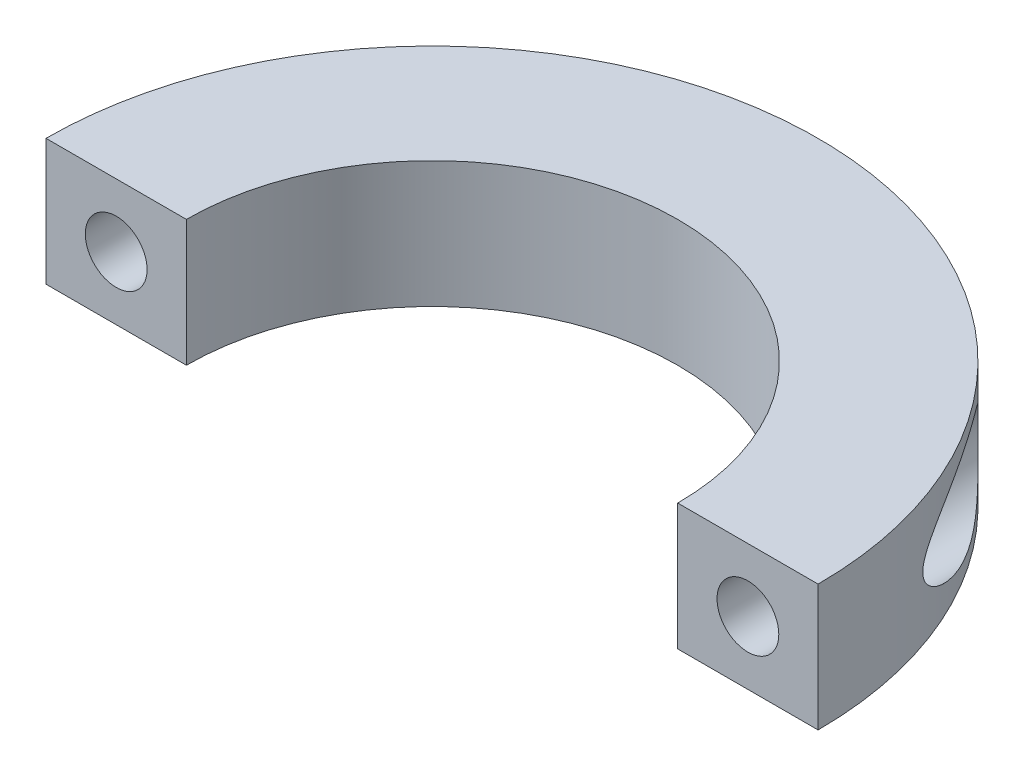
ISO-10303-21;
HEADER;
FILE_DESCRIPTION(('STEP AP214'),'2;1');
FILE_NAME('part.step','',(''),(''),'','','');
FILE_SCHEMA(('AUTOMOTIVE_DESIGN { 1 0 10303 214 1 1 1 1 }'));
ENDSEC;
DATA;
#1=APPLICATION_CONTEXT('core data for automotive mechanical design processes');
#2=APPLICATION_PROTOCOL_DEFINITION('international standard','automotive_design',2000,#1);
#3=PRODUCT_CONTEXT('',#1,'mechanical');
#4=PRODUCT('Part','Part','',(#3));
#5=PRODUCT_RELATED_PRODUCT_CATEGORY('part','',(#4));
#6=PRODUCT_DEFINITION_FORMATION('','',#4);
#7=PRODUCT_DEFINITION_CONTEXT('part definition',#1,'design');
#8=PRODUCT_DEFINITION('design','',#6,#7);
#9=PRODUCT_DEFINITION_SHAPE('','',#8);
#10=(LENGTH_UNIT() NAMED_UNIT(*) SI_UNIT(.MILLI.,.METRE.));
#11=(NAMED_UNIT(*) PLANE_ANGLE_UNIT() SI_UNIT($,.RADIAN.));
#12=(NAMED_UNIT(*) SI_UNIT($,.STERADIAN.) SOLID_ANGLE_UNIT());
#13=UNCERTAINTY_MEASURE_WITH_UNIT(LENGTH_MEASURE(1.E-05),#10,'distance_accuracy_value','');
#14=(GEOMETRIC_REPRESENTATION_CONTEXT(3) GLOBAL_UNCERTAINTY_ASSIGNED_CONTEXT((#13)) GLOBAL_UNIT_ASSIGNED_CONTEXT((#10,
#11,#12)) REPRESENTATION_CONTEXT('',''));
#15=CARTESIAN_POINT('',(0.,0.,0.));
#16=DIRECTION('',(0.,0.,1.));
#17=DIRECTION('',(1.,0.,0.));
#18=AXIS2_PLACEMENT_3D('',#15,#16,#17);
#19=CARTESIAN_POINT('',(0.,-4.5,0.));
#20=DIRECTION('',(0.,1.,0.));
#21=DIRECTION('',(0.,0.,1.));
#22=AXIS2_PLACEMENT_3D('',#19,#20,#21);
#23=CYLINDRICAL_SURFACE('',#22,17.5);
#24=DIRECTION('',(0.,1.,0.));
#25=VECTOR('',#24,1.);
#26=CARTESIAN_POINT('',(17.5,-4.5,0.));
#27=LINE('',#26,#25);
#28=CARTESIAN_POINT('',(17.5,-4.5,0.));
#29=VERTEX_POINT('',#28);
#30=CARTESIAN_POINT('',(17.5,4.5,0.));
#31=VERTEX_POINT('',#30);
#32=EDGE_CURVE('E83',#29,#31,#27,.T.);
#33=ORIENTED_EDGE('',*,*,#32,.T.);
#34=CARTESIAN_POINT('',(0.,4.5,0.));
#35=DIRECTION('',(0.,-1.,0.));
#36=DIRECTION('',(0.,0.,1.));
#37=AXIS2_PLACEMENT_3D('',#34,#35,#36);
#38=CIRCLE('',#37,17.5);
#39=CARTESIAN_POINT('',(-17.5,4.5,0.));
#40=VERTEX_POINT('',#39);
#41=EDGE_CURVE('E86',#40,#31,#38,.T.);
#42=ORIENTED_EDGE('',*,*,#41,.F.);
#43=DIRECTION('',(0.,1.,0.));
#44=VECTOR('',#43,1.);
#45=CARTESIAN_POINT('',(-17.5,-4.5,0.));
#46=LINE('',#45,#44);
#47=CARTESIAN_POINT('',(-17.5,-4.5,0.));
#48=VERTEX_POINT('',#47);
#49=EDGE_CURVE('E11',#48,#40,#46,.T.);
#50=ORIENTED_EDGE('',*,*,#49,.F.);
#51=CARTESIAN_POINT('',(0.,-4.5,0.));
#52=DIRECTION('',(0.,-1.,0.));
#53=DIRECTION('',(0.,0.,1.));
#54=AXIS2_PLACEMENT_3D('',#51,#52,#53);
#55=CIRCLE('',#54,17.5);
#56=EDGE_CURVE('E87',#48,#29,#55,.T.);
#57=ORIENTED_EDGE('',*,*,#56,.T.);
#58=EDGE_LOOP('',(#33,#42,#50,#57));
#59=FACE_BOUND('',#58,.T.);
#60=ADVANCED_FACE('F39',(#59),#23,.F.);
#61=CARTESIAN_POINT('',(-27.5,-4.5,0.));
#62=DIRECTION('',(0.,0.,1.));
#63=DIRECTION('',(1.,0.,0.));
#64=AXIS2_PLACEMENT_3D('',#61,#62,#63);
#65=PLANE('',#64);
#66=CARTESIAN_POINT('',(-22.5,0.,0.));
#67=DIRECTION('',(0.,0.,1.));
#68=DIRECTION('',(1.,0.,0.));
#69=AXIS2_PLACEMENT_3D('',#66,#67,#68);
#70=CIRCLE('',#69,2.2);
#71=CARTESIAN_POINT('',(-20.3,0.,0.));
#72=VERTEX_POINT('',#71);
#73=EDGE_CURVE('E108',#72,#72,#70,.T.);
#74=ORIENTED_EDGE('',*,*,#73,.F.);
#75=EDGE_LOOP('',(#74));
#76=FACE_BOUND('',#75,.T.);
#77=ORIENTED_EDGE('',*,*,#49,.T.);
#78=DIRECTION('',(1.,0.,0.));
#79=VECTOR('',#78,1.);
#80=CARTESIAN_POINT('',(-27.5,4.5,0.));
#81=LINE('',#80,#79);
#82=CARTESIAN_POINT('',(-27.5,4.5,0.));
#83=VERTEX_POINT('',#82);
#84=EDGE_CURVE('E106',#83,#40,#81,.T.);
#85=ORIENTED_EDGE('',*,*,#84,.F.);
#86=DIRECTION('',(0.,1.,0.));
#87=VECTOR('',#86,1.);
#88=CARTESIAN_POINT('',(-27.5,-4.5,0.));
#89=LINE('',#88,#87);
#90=CARTESIAN_POINT('',(-27.5,-4.5,0.));
#91=VERTEX_POINT('',#90);
#92=EDGE_CURVE('E53',#91,#83,#89,.T.);
#93=ORIENTED_EDGE('',*,*,#92,.F.);
#94=DIRECTION('',(1.,0.,0.));
#95=VECTOR('',#94,1.);
#96=CARTESIAN_POINT('',(-27.5,-4.5,0.));
#97=LINE('',#96,#95);
#98=EDGE_CURVE('E93',#91,#48,#97,.T.);
#99=ORIENTED_EDGE('',*,*,#98,.T.);
#100=EDGE_LOOP('',(#77,#85,#93,#99));
#101=FACE_BOUND('',#100,.T.);
#102=ADVANCED_FACE('F173',(#76,#101),#65,.T.);
#103=CARTESIAN_POINT('',(0.,-4.5,0.));
#104=DIRECTION('',(0.,1.,0.));
#105=DIRECTION('',(0.,0.,1.));
#106=AXIS2_PLACEMENT_3D('',#103,#104,#105);
#107=CYLINDRICAL_SURFACE('',#106,27.5);
#108=CARTESIAN_POINT('',(-19.,0.,-19.880895352071));
#109=CARTESIAN_POINT('',(-18.9999971791274,-0.0779457798312224,-19.8808976556455));
#110=CARTESIAN_POINT('',(-19.0026068691748,-0.15586897493757,-19.8784048678155));
#111=CARTESIAN_POINT('',(-19.0129849287331,-0.311080770032434,-19.8684790384647));
#112=CARTESIAN_POINT('',(-19.0207544627473,-0.388369222781524,-19.861044881747));
#113=CARTESIAN_POINT('',(-19.0413079736059,-0.541696562054865,-19.8413404759286));
#114=CARTESIAN_POINT('',(-19.054094903773,-0.617734685098973,-19.8290673785265));
#115=CARTESIAN_POINT('',(-19.084428915456,-0.767958149424388,-19.7998740770613));
#116=CARTESIAN_POINT('',(-19.1019780775438,-0.8421426653763,-19.7829518417957));
#117=CARTESIAN_POINT('',(-19.1610846767829,-1.06027381629675,-19.7257659688221));
#118=CARTESIAN_POINT('',(-19.2092430518155,-1.20081187844159,-19.6789488971131));
#119=CARTESIAN_POINT('',(-19.3201023467371,-1.46951190072422,-19.5701217052577));
#120=CARTESIAN_POINT('',(-19.382807924264,-1.59766987842572,-19.508106718773));
#121=CARTESIAN_POINT('',(-19.5431908450772,-1.88209807650995,-19.3476220559081));
#122=CARTESIAN_POINT('',(-19.6454744153863,-2.03284582998911,-19.2439534130517));
#123=CARTESIAN_POINT('',(-19.8636530121569,-2.30884956799362,-19.0186765351433));
#124=CARTESIAN_POINT('',(-19.9795732461325,-2.43405713560172,-18.8970349672809));
#125=CARTESIAN_POINT('',(-20.2686482156656,-2.70648283273861,-18.5874357543178));
#126=CARTESIAN_POINT('',(-20.4458199358138,-2.84175699340713,-18.392703751731));
#127=CARTESIAN_POINT('',(-20.7154563465624,-3.01276741687075,-18.0869762023362));
#128=CARTESIAN_POINT('',(-20.8060880390939,-3.06449512826581,-17.9826676601357));
#129=CARTESIAN_POINT('',(-20.9878709432629,-3.15814908447452,-17.7701642922292));
#130=CARTESIAN_POINT('',(-21.0790220490352,-3.20007725821468,-17.6619702361872));
#131=CARTESIAN_POINT('',(-21.3088136291208,-3.29447993520242,-17.3848121568381));
#132=CARTESIAN_POINT('',(-21.4473207568858,-3.3409752882621,-17.2137010658852));
#133=CARTESIAN_POINT('',(-21.7220566233864,-3.41541582142362,-16.8656894313854));
#134=CARTESIAN_POINT('',(-21.8582841470943,-3.44335139805042,-16.6887859402441));
#135=CARTESIAN_POINT('',(-22.1275342380828,-3.48279008049264,-16.3301144245123));
#136=CARTESIAN_POINT('',(-22.2605480272295,-3.49425229617912,-16.148335432139));
#137=CARTESIAN_POINT('',(-22.5221746819991,-3.50237478979053,-15.7813959594979));
#138=CARTESIAN_POINT('',(-22.6507878950857,-3.49903623909505,-15.5962357479858));
#139=CARTESIAN_POINT('',(-22.9636310756763,-3.4742126021279,-15.1338208646235));
#140=CARTESIAN_POINT('',(-23.14494199997,-3.44479021433209,-14.8549998008048));
#141=CARTESIAN_POINT('',(-23.495728467639,-3.3602226763415,-14.2937198708311));
#142=CARTESIAN_POINT('',(-23.6651963798946,-3.30506111349446,-14.011258795525));
#143=CARTESIAN_POINT('',(-23.991275060736,-3.17129276706664,-13.4452655711049));
#144=CARTESIAN_POINT('',(-24.1479102852803,-3.09273196754409,-13.1617365897985));
#145=CARTESIAN_POINT('',(-24.4481718907387,-2.91294808906257,-12.5952196985155));
#146=CARTESIAN_POINT('',(-24.5918068849591,-2.81174017163228,-12.3122315537057));
#147=CARTESIAN_POINT('',(-24.8361376453152,-2.60995459611937,-11.8100169904723));
#148=CARTESIAN_POINT('',(-24.9394099956247,-2.51395566079564,-11.5902115039586));
#149=CARTESIAN_POINT('',(-25.0878792234514,-2.35754874474312,-11.2633340228417));
#150=CARTESIAN_POINT('',(-25.1363269735699,-2.30330326821357,-11.1547726724655));
#151=CARTESIAN_POINT('',(-25.2309609632434,-2.19027216841237,-10.9390342854329));
#152=CARTESIAN_POINT('',(-25.2771473688929,-2.13148687940742,-10.8318571475338));
#153=CARTESIAN_POINT('',(-25.3674785480645,-2.0083438707196,-10.618594281452));
#154=CARTESIAN_POINT('',(-25.4116046915089,-1.94394643912332,-10.5125234823292));
#155=CARTESIAN_POINT('',(-25.4972106255542,-1.8091724728327,-10.3031562574759));
#156=CARTESIAN_POINT('',(-25.5386910404188,-1.73879735778836,-10.1998591806366));
#157=CARTESIAN_POINT('',(-25.6186092912167,-1.59101534207066,-9.99743328232487));
#158=CARTESIAN_POINT('',(-25.6570520624645,-1.51362030542874,-9.89829782759365));
#159=CARTESIAN_POINT('',(-25.7303547202177,-1.35012454585914,-9.70615126585617));
#160=CARTESIAN_POINT('',(-25.7652193116966,-1.26403555821176,-9.61313217579865));
#161=CARTESIAN_POINT('',(-25.8265192575974,-1.09161970424177,-9.44710478170627));
#162=CARTESIAN_POINT('',(-25.8534637925848,-1.00651811434257,-9.37303026183036));
#163=CARTESIAN_POINT('',(-25.902429469078,-0.825941013191429,-9.23684649682055));
#164=CARTESIAN_POINT('',(-25.9244660248154,-0.73049942122704,-9.17469987786064));
#165=CARTESIAN_POINT('',(-25.9546176554801,-0.565519347432291,-9.08895427842221));
#166=CARTESIAN_POINT('',(-25.9648695673937,-0.499411757239799,-9.05959213372738));
#167=CARTESIAN_POINT('',(-25.9817868561843,-0.363122051524953,-9.01096088508816));
#168=CARTESIAN_POINT('',(-25.9884568455804,-0.292945305666632,-8.99167880168435));
#169=CARTESIAN_POINT('',(-25.9975604018447,-0.149279940869494,-8.96532571096397));
#170=CARTESIAN_POINT('',(-25.9999527422793,-0.0757660215250959,-8.95837354002531));
#171=CARTESIAN_POINT('',(-26.0000458275151,0.0712912730148066,-8.95810347810568));
#172=CARTESIAN_POINT('',(-25.9977469626099,0.144834645250975,-8.96478445288944));
#173=CARTESIAN_POINT('',(-25.9892978339074,0.280922648423502,-8.98924518373483));
#174=CARTESIAN_POINT('',(-25.9836231498045,0.343756443536922,-9.0056536863411));
#175=CARTESIAN_POINT('',(-25.9693505902236,0.466278231825745,-9.04672897008787));
#176=CARTESIAN_POINT('',(-25.9607511075294,0.525964474505216,-9.07140029164398));
#177=CARTESIAN_POINT('',(-25.9339556063241,0.684367370803288,-9.14781627561374));
#178=CARTESIAN_POINT('',(-25.9133546770371,0.779481252044492,-9.20612306116977));
#179=CARTESIAN_POINT('',(-25.8671729940052,0.959611863661491,-9.33510004704475));
#180=CARTESIAN_POINT('',(-25.841573739593,1.04458913215932,-9.40581607699231));
#181=CARTESIAN_POINT('',(-25.7859448958846,1.20840935438589,-9.55728825179903));
#182=CARTESIAN_POINT('',(-25.7558050701832,1.28699037696477,-9.63828268780315));
#183=CARTESIAN_POINT('',(-25.692513816654,1.43682744606434,-9.80575196973132));
#184=CARTESIAN_POINT('',(-25.6593591229585,1.50807536656666,-9.89223272733431));
#185=CARTESIAN_POINT('',(-25.5904788327329,1.64462593971781,-10.0690825997467));
#186=CARTESIAN_POINT('',(-25.5547477001751,1.70991506334076,-10.1594599089629));
#187=CARTESIAN_POINT('',(-25.4810966442095,1.8353046845542,-10.3427983094679));
#188=CARTESIAN_POINT('',(-25.4431775690033,1.89540717060056,-10.4357583923397));
#189=CARTESIAN_POINT('',(-25.3578503256165,2.02227782962352,-10.6416215411166));
#190=CARTESIAN_POINT('',(-25.3100186449763,2.0881084346992,-10.7549250879554));
#191=CARTESIAN_POINT('',(-25.2116974716725,2.21429218971609,-10.983432730382));
#192=CARTESIAN_POINT('',(-25.1612073529849,2.27464404029201,-11.0986372692012));
#193=CARTESIAN_POINT('',(-25.0576627511349,2.39048134282413,-11.3304751848334));
#194=CARTESIAN_POINT('',(-25.004606037017,2.44596243866232,-11.4471097364508));
#195=CARTESIAN_POINT('',(-24.8960547456358,2.55238967911932,-11.6813154900585));
#196=CARTESIAN_POINT('',(-24.8405598946141,2.60333531253458,-11.7988867960097));
#197=CARTESIAN_POINT('',(-24.6702968123395,2.74996753783678,-12.1529865285069));
#198=CARTESIAN_POINT('',(-24.5519382829241,2.83924158218754,-12.3904779846394));
#199=CARTESIAN_POINT('',(-24.3060943422441,3.00161317559123,-12.866058752437));
#200=CARTESIAN_POINT('',(-24.1786130935919,3.07471804098182,-13.1041477441995));
#201=CARTESIAN_POINT('',(-23.8997134571764,3.21210833637423,-13.6068136780487));
#202=CARTESIAN_POINT('',(-23.7472203276639,3.27445162447818,-13.8713305518946));
#203=CARTESIAN_POINT('',(-23.4314761603367,3.37786238056236,-14.3982749941111));
#204=CARTESIAN_POINT('',(-23.2682207115418,3.41892106308152,-14.660701655788));
#205=CARTESIAN_POINT('',(-22.9322009259421,3.47738144282944,-15.180897531599));
#206=CARTESIAN_POINT('',(-22.7594709036098,3.49486331272668,-15.4386795736255));
#207=CARTESIAN_POINT('',(-22.4052679045831,3.50319792873526,-15.9483618348537));
#208=CARTESIAN_POINT('',(-22.2238022994995,3.49407275308971,-16.2002667559451));
#209=CARTESIAN_POINT('',(-21.8417518876648,3.44328689020648,-16.712151759253));
#210=CARTESIAN_POINT('',(-21.640689800531,3.39955863174205,-16.9715992425979));
#211=CARTESIAN_POINT('',(-21.3363419710716,3.30260544183445,-17.3504150687049));
#212=CARTESIAN_POINT('',(-21.2344238610341,3.2650559035812,-17.4749723408197));
#213=CARTESIAN_POINT('',(-21.0304616518422,3.17847951897467,-17.71990587447));
#214=CARTESIAN_POINT('',(-20.9284175805254,3.12945487002456,-17.8402829314256));
#215=CARTESIAN_POINT('',(-20.664559711301,2.98585300890134,-18.1462796526936));
#216=CARTESIAN_POINT('',(-20.5033632742298,2.88153923280105,-18.328033627388));
#217=CARTESIAN_POINT('',(-20.189366385215,2.6363790914045,-18.6733413961038));
#218=CARTESIAN_POINT('',(-20.0365518866134,2.49559625874431,-18.836926141542));
#219=CARTESIAN_POINT('',(-19.7894417916089,2.21963488517625,-19.0958244175638));
#220=CARTESIAN_POINT('',(-19.6908365346584,2.09417834603825,-19.197346553291));
#221=CARTESIAN_POINT('',(-19.5073961037445,1.82238847566768,-19.383718208296));
#222=CARTESIAN_POINT('',(-19.4225464417608,1.67607741873457,-19.4685852895414));
#223=CARTESIAN_POINT('',(-19.2846235403931,1.39004532968712,-19.6051306277711));
#224=CARTESIAN_POINT('',(-19.2286133908911,1.25326374714943,-19.659979828689));
#225=CARTESIAN_POINT('',(-19.1333625581736,0.968590655021148,-19.7526932747978));
#226=CARTESIAN_POINT('',(-19.0940970062765,0.82071600741722,-19.7905827124132));
#227=CARTESIAN_POINT('',(-19.0433452399472,0.560276303843313,-19.8394014692677));
#228=CARTESIAN_POINT('',(-19.0271551042098,0.449452021575508,-19.8549131817372));
#229=CARTESIAN_POINT('',(-19.0054837878518,0.225736236180496,-19.875659164227));
#230=CARTESIAN_POINT('',(-19.0000040838622,0.112844450174997,-19.880892017117));
#231=CARTESIAN_POINT('',(-19.,0.,-19.880895352071));
#232=B_SPLINE_CURVE_WITH_KNOTS('',3,(#108,#109,#110,#111,#112,#113,#114,#115,#116,#117,#118,
#119,#120,#121,#122,#123,#124,#125,#126,#127,#128,#129,#130,#131,#132,#133,#134,#135,#136,#137,
#138,#139,#140,#141,#142,#143,#144,#145,#146,#147,#148,#149,#150,#151,#152,#153,#154,#155,#156,
#157,#158,#159,#160,#161,#162,#163,#164,#165,#166,#167,#168,#169,#170,#171,#172,#173,#174,#175,
#176,#177,#178,#179,#180,#181,#182,#183,#184,#185,#186,#187,#188,#189,#190,#191,#192,#193,#194,
#195,#196,#197,#198,#199,#200,#201,#202,#203,#204,#205,#206,#207,#208,#209,#210,#211,#212,#213,
#214,#215,#216,#217,#218,#219,#220,#221,#222,#223,#224,#225,#226,#227,#228,#229,#230,#231),
.UNSPECIFIED.,.T.,.F.,(4,2,2,2,2,2,2,2,2,2,2,2,2,2,2,2,2,2,2,2,2,2,2,2,2,2,2,2,2,2,2,2,2,2,2,2,
2,2,2,2,2,2,2,2,2,2,2,2,2,2,2,2,2,2,2,2,2,2,2,2,2,4),(0.,0.233715078114964,0.467482920330904,
0.701388569094977,0.935396573906926,1.40035683269558,1.86546616568262,2.49078490324287,
3.11727827028647,4.00001865584922,4.44240704087204,4.88470827334342,5.5586820388962,
6.23300427091664,6.90899742981793,7.58493708943195,8.58515437317234,9.58601032148392,
10.5849122265264,11.5831473885071,12.3659282432587,12.7578603028049,13.1497635318312,
13.5447087507641,13.9395604343569,14.3337568086301,14.7274280253092,15.0746747050686,
15.4208149251403,15.6392782572263,15.8574595906366,16.0777325689052,16.2979872218953,
16.4927986584394,16.6877173199051,17.0260855604102,17.3657308188101,17.7156083951687,
18.0658695984385,18.4169072288233,18.7678096747182,19.1861230392245,19.6045353549732,
20.0233181411344,20.4421480697679,21.2813264277622,22.1201242883742,23.0541052689756,
23.9884714544218,24.9196522592342,25.8500606000805,26.8406877979443,27.3360946118559,
27.8314066363381,28.6218640173642,29.4109534988385,29.9763809253979,30.5412088936004,
31.0122532756024,31.4825956163483,31.8209053264393,32.1592616754886),.UNSPECIFIED.);
#233=CARTESIAN_POINT('',(-19.,0.,-19.880895352071));
#234=VERTEX_POINT('',#233);
#235=EDGE_CURVE('E42',#234,#234,#232,.T.);
#236=ORIENTED_EDGE('',*,*,#235,.F.);
#237=EDGE_LOOP('',(#236));
#238=FACE_BOUND('',#237,.T.);
#239=CARTESIAN_POINT('',(26.,0.,-8.95823643358446));
#240=CARTESIAN_POINT('',(25.9999960783478,-0.0752856305826726,-8.95824885471689));
#241=CARTESIAN_POINT('',(25.9975368716486,-0.150619534090962,-8.96539497160827));
#242=CARTESIAN_POINT('',(25.9880370616513,-0.298554123860328,-8.99289288521724));
#243=CARTESIAN_POINT('',(25.9809872126064,-0.371148980726383,-9.01327133216935));
#244=CARTESIAN_POINT('',(25.9605819411024,-0.531634843966275,-9.07190058762227));
#245=CARTESIAN_POINT('',(25.9460115553653,-0.618094512895848,-9.11356377049327));
#246=CARTESIAN_POINT('',(25.9123187060843,-0.783085802110154,-9.20892466738029));
#247=CARTESIAN_POINT('',(25.8931847952657,-0.861596766585115,-9.26265262486606));
#248=CARTESIAN_POINT('',(25.8530193449964,-1.0062254380763,-9.37414895347102));
#249=CARTESIAN_POINT('',(25.8322084513039,-1.07282400472254,-9.4313862381541));
#250=CARTESIAN_POINT('',(25.7883016363585,-1.20068566205073,-9.55078798731658));
#251=CARTESIAN_POINT('',(25.7652035958218,-1.26194370346668,-9.61295701076646));
#252=CARTESIAN_POINT('',(25.7171001728338,-1.37997564710699,-9.74091595318129));
#253=CARTESIAN_POINT('',(25.6920912331129,-1.43674076501325,-9.80671255848746));
#254=CARTESIAN_POINT('',(25.6404622329455,-1.54633928800311,-9.94091906310229));
#255=CARTESIAN_POINT('',(25.6138415613838,-1.59917118459607,-10.0093299499873));
#256=CARTESIAN_POINT('',(25.5544100583299,-1.71032651990393,-10.1602063359163));
#257=CARTESIAN_POINT('',(25.5213293431618,-1.76800077026058,-10.2430422083573));
#258=CARTESIAN_POINT('',(25.4533959808202,-1.87928003919505,-10.4107075275869));
#259=CARTESIAN_POINT('',(25.4185428943667,-1.9328840406782,-10.495537465773));
#260=CARTESIAN_POINT('',(25.3114714204252,-2.08842861702429,-10.7523847857654));
#261=CARTESIAN_POINT('',(25.2367906488205,-2.18501107860851,-10.9266326099567));
#262=CARTESIAN_POINT('',(25.0813258726783,-2.36665197350055,-11.2789331417097));
#263=CARTESIAN_POINT('',(25.0005266899526,-2.45168018126916,-11.4569944698806));
#264=CARTESIAN_POINT('',(24.833321774291,-2.61131389728803,-11.8150391166812));
#265=CARTESIAN_POINT('',(24.7469181730454,-2.68592333475856,-11.995021683041));
#266=CARTESIAN_POINT('',(24.5852840597835,-2.81248313657238,-12.3223635512093));
#267=CARTESIAN_POINT('',(24.510972804504,-2.86606489165993,-12.4695506195549));
#268=CARTESIAN_POINT('',(24.3588144656026,-2.96700861073263,-12.7642341179241));
#269=CARTESIAN_POINT('',(24.2809670931732,-3.01437006544941,-12.9117305722746));
#270=CARTESIAN_POINT('',(24.0421093840475,-3.14724697161322,-13.3543751548349));
#271=CARTESIAN_POINT('',(23.8758475745192,-3.22350496785961,-13.649548259352));
#272=CARTESIAN_POINT('',(23.5303435900764,-3.34994499136952,-14.2368828402827));
#273=CARTESIAN_POINT('',(23.3511329629854,-3.40018811105375,-14.5290497787489));
#274=CARTESIAN_POINT('',(22.980243397583,-3.47203402049955,-15.1088240470898));
#275=CARTESIAN_POINT('',(22.7885751853182,-3.4936611148928,-15.3964350410647));
#276=CARTESIAN_POINT('',(22.4805545747091,-3.50169886770226,-15.8402201924753));
#277=CARTESIAN_POINT('',(22.367944877801,-3.49937836807673,-15.998838476473));
#278=CARTESIAN_POINT('',(22.1396772413998,-3.48328330352339,-16.3132579166428));
#279=CARTESIAN_POINT('',(22.0240201230328,-3.46951179411289,-16.4690598129926));
#280=CARTESIAN_POINT('',(21.7903181606682,-3.42934364051533,-16.77704914402));
#281=CARTESIAN_POINT('',(21.6722751821472,-3.402956520442,-16.9292392146061));
#282=CARTESIAN_POINT('',(21.4345677188001,-3.33617964067749,-17.2292164754013));
#283=CARTESIAN_POINT('',(21.3149036764738,-3.2957936310792,-17.3770048332611));
#284=CARTESIAN_POINT('',(21.1054226812179,-3.21161425446235,-17.6303969343267));
#285=CARTESIAN_POINT('',(21.0157064470705,-3.17126215596263,-17.7372216072499));
#286=CARTESIAN_POINT('',(20.8366938477452,-3.08114666783685,-17.9471810022555));
#287=CARTESIAN_POINT('',(20.7473975747405,-3.03138130271321,-18.0503149443771));
#288=CARTESIAN_POINT('',(20.4815380912144,-2.86691296063408,-18.3528743385519));
#289=CARTESIAN_POINT('',(20.3065837699661,-2.73687881759595,-18.5459637633866));
#290=CARTESIAN_POINT('',(20.0203651348795,-2.47531988232534,-18.8537968519796));
#291=CARTESIAN_POINT('',(19.9054302466055,-2.35533689776992,-18.9749453107726));
#292=CARTESIAN_POINT('',(19.6879368851688,-2.09082113102973,-19.200508577389));
#293=CARTESIAN_POINT('',(19.5853616348415,-1.94632228399168,-19.3049461335133));
#294=CARTESIAN_POINT('',(19.416918728633,-1.66319511105105,-19.4742071280751));
#295=CARTESIAN_POINT('',(19.3477864926135,-1.52880154943666,-19.5427860931479));
#296=CARTESIAN_POINT('',(19.2561796781354,-1.31665737179256,-19.6329158314003));
#297=CARTESIAN_POINT('',(19.2276512554195,-1.24415572621915,-19.6608437015468));
#298=CARTESIAN_POINT('',(19.1750949680134,-1.09598158077855,-19.7121049116947));
#299=CARTESIAN_POINT('',(19.1510651234007,-1.02031049388198,-19.7354402731922));
#300=CARTESIAN_POINT('',(19.1077771453866,-0.865635648345299,-19.7773549752626));
#301=CARTESIAN_POINT('',(19.088558235522,-0.786610272901389,-19.795895259736));
#302=CARTESIAN_POINT('',(19.0555443208845,-0.626425552790786,-19.8276765147816));
#303=CARTESIAN_POINT('',(19.0417466612131,-0.54526727347929,-19.8409200793244));
#304=CARTESIAN_POINT('',(19.0198732183261,-0.3814912211482,-19.8618895459819));
#305=CARTESIAN_POINT('',(19.0117959290486,-0.298873838157634,-19.8696169004114));
#306=CARTESIAN_POINT('',(19.0015374408611,-0.132970342695389,-19.8794269385798));
#307=CARTESIAN_POINT('',(18.9993555405649,-0.0496843109568159,-19.8815102937967));
#308=CARTESIAN_POINT('',(19.0015747366301,0.179698998727359,-19.8793920753636));
#309=CARTESIAN_POINT('',(19.0121854979526,0.325770625819391,-19.8692618594891));
#310=CARTESIAN_POINT('',(19.0510733827562,0.613176995729302,-19.8319764524728));
#311=CARTESIAN_POINT('',(19.0793490680812,0.754512123173422,-19.8048226472736));
#312=CARTESIAN_POINT('',(19.1514527007965,1.02817013063998,-19.7351039657708));
#313=CARTESIAN_POINT('',(19.1951877426778,1.16054133833688,-19.6926311213133));
#314=CARTESIAN_POINT('',(19.2957559867083,1.414761847994,-19.5941001099086));
#315=CARTESIAN_POINT('',(19.3525947215264,1.53660667552538,-19.538036203998));
#316=CARTESIAN_POINT('',(19.5018663884763,1.81528124735756,-19.3892296969381));
#317=CARTESIAN_POINT('',(19.5994033719289,1.96636393503704,-19.29081860625));
#318=CARTESIAN_POINT('',(19.8084710796404,2.24411494685171,-19.0760868177337));
#319=CARTESIAN_POINT('',(19.920029652603,2.37073337551559,-18.9597303706626));
#320=CARTESIAN_POINT('',(20.1978676275684,2.64616643597028,-18.6641792859778));
#321=CARTESIAN_POINT('',(20.3682633353261,2.78377845509337,-18.4783987387399));
#322=CARTESIAN_POINT('',(20.6284459523984,2.95943813770239,-18.1861094075333));
#323=CARTESIAN_POINT('',(20.7160395119708,3.01290776550077,-18.0862898365713));
#324=CARTESIAN_POINT('',(20.8919849535778,3.11036766346176,-17.8827565798142));
#325=CARTESIAN_POINT('',(20.9803366843055,3.15435978129895,-17.7790436576798));
#326=CARTESIAN_POINT('',(21.2028227541339,3.25406734583957,-17.5138183990309));
#327=CARTESIAN_POINT('',(21.3369819655194,3.30406345227343,-17.3501768674199));
#328=CARTESIAN_POINT('',(21.6035785137873,3.38613152721315,-17.0170788534448));
#329=CARTESIAN_POINT('',(21.7360149373017,3.4181943383363,-16.8476194470548));
#330=CARTESIAN_POINT('',(21.9982009468508,3.46641100177799,-16.5038177224093));
#331=CARTESIAN_POINT('',(22.127943445453,3.48252708732929,-16.3294648133601));
#332=CARTESIAN_POINT('',(22.3835513088113,3.50040658169246,-15.9772966265548));
#333=CARTESIAN_POINT('',(22.5094169486781,3.50217101127878,-15.799481595947));
#334=CARTESIAN_POINT('',(22.8183943867969,3.49042294443917,-15.3517821043276));
#335=CARTESIAN_POINT('',(22.9987597491861,3.46885500016332,-15.0801956488859));
#336=CARTESIAN_POINT('',(23.3483863837597,3.4002932235758,-14.5330116325601));
#337=CARTESIAN_POINT('',(23.517640581775,3.35328336581302,-14.257411650204));
#338=CARTESIAN_POINT('',(23.8440155551079,3.23629783291749,-13.7045898564791));
#339=CARTESIAN_POINT('',(24.0011560607718,3.16636052101309,-13.4273715089118));
#340=CARTESIAN_POINT('',(24.3031050226261,3.00468952406583,-12.8727874504537));
#341=CARTESIAN_POINT('',(24.4479208655304,2.91296902140748,-12.5954219295246));
#342=CARTESIAN_POINT('',(24.6937082108274,2.73047247795617,-12.1048837673904));
#343=CARTESIAN_POINT('',(24.7972106699249,2.64413242128221,-11.8913170825675));
#344=CARTESIAN_POINT('',(24.996461146747,2.45691753351715,-11.4665562552839));
#345=CARTESIAN_POINT('',(25.0922015087937,2.35602861904703,-11.2553646279191));
#346=CARTESIAN_POINT('',(25.2344189745086,2.18612983723485,-10.9311518208335));
#347=CARTESIAN_POINT('',(25.28382900941,2.12296099292677,-10.8163415158143));
#348=CARTESIAN_POINT('',(25.3798805619721,1.99072274541962,-10.5889973622764));
#349=CARTESIAN_POINT('',(25.4265227889074,1.92165486506226,-10.4764629354596));
#350=CARTESIAN_POINT('',(25.5166600890272,1.77680120651768,-10.2549653409206));
#351=CARTESIAN_POINT('',(25.5601635211002,1.70103456477848,-10.1459931451395));
#352=CARTESIAN_POINT('',(25.6436959945566,1.5412064937812,-9.93297024387155));
#353=CARTESIAN_POINT('',(25.6837282404877,1.457152871529,-9.82891504036636));
#354=CARTESIAN_POINT('',(25.7511465719749,1.2983602872607,-9.65066940052125));
#355=CARTESIAN_POINT('',(25.7793687576706,1.22568720898235,-9.57497213786177));
#356=CARTESIAN_POINT('',(25.8326507829498,1.07239843587308,-9.43027552959871));
#357=CARTESIAN_POINT('',(25.8577030584506,0.991764530958013,-9.3612922922868));
#358=CARTESIAN_POINT('',(25.9038384133008,0.819743179947783,-9.23286875351419));
#359=CARTESIAN_POINT('',(25.924848077187,0.728198397880399,-9.17360741047245));
#360=CARTESIAN_POINT('',(25.9602809795443,0.534734639226685,-9.07285477521335));
#361=CARTESIAN_POINT('',(25.9747452353466,0.432885304380925,-9.03125292316367));
#362=CARTESIAN_POINT('',(25.9896684637003,0.274007890279411,-8.98817924461325));
#363=CARTESIAN_POINT('',(25.9935150417662,0.219893838773729,-8.97703954417528));
#364=CARTESIAN_POINT('',(25.9986821172108,0.110528452913357,-8.96206396149893));
#365=CARTESIAN_POINT('',(26.0000028794088,0.0552772383985918,-8.95822731357187));
#366=CARTESIAN_POINT('',(26.,0.,-8.95823643358446));
#367=B_SPLINE_CURVE_WITH_KNOTS('',3,(#239,#240,#241,#242,#243,#244,#245,#246,#247,#248,#249,
#250,#251,#252,#253,#254,#255,#256,#257,#258,#259,#260,#261,#262,#263,#264,#265,#266,#267,#268,
#269,#270,#271,#272,#273,#274,#275,#276,#277,#278,#279,#280,#281,#282,#283,#284,#285,#286,#287,
#288,#289,#290,#291,#292,#293,#294,#295,#296,#297,#298,#299,#300,#301,#302,#303,#304,#305,#306,
#307,#308,#309,#310,#311,#312,#313,#314,#315,#316,#317,#318,#319,#320,#321,#322,#323,#324,#325,
#326,#327,#328,#329,#330,#331,#332,#333,#334,#335,#336,#337,#338,#339,#340,#341,#342,#343,#344,
#345,#346,#347,#348,#349,#350,#351,#352,#353,#354,#355,#356,#357,#358,#359,#360,#361,#362,#363,
#364,#365,#366),.UNSPECIFIED.,.T.,.F.,(4,2,2,2,2,2,2,2,2,2,2,2,2,2,2,2,2,2,2,2,2,2,2,2,2,2,2,2,
2,2,2,2,2,2,2,2,2,2,2,2,2,2,2,2,2,2,2,2,2,2,2,2,2,2,2,2,2,2,2,2,2,2,2,4),(0.,0.225597482124107,
0.451650738280384,0.741201843695793,1.03148705104814,1.30183142543504,1.57242868934915,
1.8435425724699,2.11475990466721,2.43327779433113,2.75187501671916,3.38955954022025,
4.0288813675215,4.66796143309806,5.18792211140031,5.70792533341724,6.74839103150611,
7.78640212630663,8.82353103338452,9.40683886879522,9.98999110784449,10.5727037915458,
11.1552604957295,11.5905736172689,12.0259781965438,12.8947737273682,13.5096644238921,
14.1237108238063,14.6194268327126,14.867463131192,15.1153900055087,15.3652768167503,
15.6150411002561,15.8647396012264,16.1144083937508,16.5524700643819,16.9904960757032,
17.4259332423437,17.8615545979915,18.473125362242,19.0859305702497,19.9424749609443,
20.3717144415994,20.8008701645996,21.4521748782575,22.1038118684978,22.7569884686503,
23.4101186106234,24.3888891626311,25.3682769451813,26.3460342664592,27.3232013860161,
28.0803814588095,28.8382994686321,29.2583079082875,29.6782082482031,30.0969455871758,
30.5152921441895,30.8408967533995,31.167264232076,31.499091761116,31.8288100486641,
31.9944686660398,32.1601099139775),.UNSPECIFIED.);
#368=CARTESIAN_POINT('',(26.,0.,-8.95823643358446));
#369=VERTEX_POINT('',#368);
#370=EDGE_CURVE('E142',#369,#369,#367,.T.);
#371=ORIENTED_EDGE('',*,*,#370,.F.);
#372=EDGE_LOOP('',(#371));
#373=FACE_BOUND('',#372,.T.);
#374=ORIENTED_EDGE('',*,*,#92,.T.);
#375=CARTESIAN_POINT('',(0.,4.5,0.));
#376=DIRECTION('',(0.,1.,0.));
#377=DIRECTION('',(0.,0.,1.));
#378=AXIS2_PLACEMENT_3D('',#375,#376,#377);
#379=CIRCLE('',#378,27.5);
#380=CARTESIAN_POINT('',(27.5,4.5,0.));
#381=VERTEX_POINT('',#380);
#382=EDGE_CURVE('E102',#381,#83,#379,.T.);
#383=ORIENTED_EDGE('',*,*,#382,.F.);
#384=DIRECTION('',(0.,1.,0.));
#385=VECTOR('',#384,1.);
#386=CARTESIAN_POINT('',(27.5,-4.5,0.));
#387=LINE('',#386,#385);
#388=CARTESIAN_POINT('',(27.5,-4.5,0.));
#389=VERTEX_POINT('',#388);
#390=EDGE_CURVE('E92',#389,#381,#387,.T.);
#391=ORIENTED_EDGE('',*,*,#390,.F.);
#392=CARTESIAN_POINT('',(0.,-4.5,0.));
#393=DIRECTION('',(0.,1.,0.));
#394=DIRECTION('',(0.,0.,1.));
#395=AXIS2_PLACEMENT_3D('',#392,#393,#394);
#396=CIRCLE('',#395,27.5);
#397=EDGE_CURVE('E125',#389,#91,#396,.T.);
#398=ORIENTED_EDGE('',*,*,#397,.T.);
#399=EDGE_LOOP('',(#374,#383,#391,#398));
#400=FACE_BOUND('',#399,.T.);
#401=ADVANCED_FACE('F149',(#238,#373,#400),#107,.T.);
#402=CARTESIAN_POINT('',(17.5,-4.5,0.));
#403=DIRECTION('',(0.,0.,1.));
#404=DIRECTION('',(1.,0.,0.));
#405=AXIS2_PLACEMENT_3D('',#402,#403,#404);
#406=PLANE('',#405);
#407=CARTESIAN_POINT('',(22.5,0.,0.));
#408=DIRECTION('',(0.,0.,1.));
#409=DIRECTION('',(1.,0.,0.));
#410=AXIS2_PLACEMENT_3D('',#407,#408,#409);
#411=CIRCLE('',#410,2.2);
#412=CARTESIAN_POINT('',(24.7,0.,0.));
#413=VERTEX_POINT('',#412);
#414=EDGE_CURVE('E112',#413,#413,#411,.T.);
#415=ORIENTED_EDGE('',*,*,#414,.F.);
#416=EDGE_LOOP('',(#415));
#417=FACE_BOUND('',#416,.T.);
#418=ORIENTED_EDGE('',*,*,#390,.T.);
#419=DIRECTION('',(1.,0.,0.));
#420=VECTOR('',#419,1.);
#421=CARTESIAN_POINT('',(17.5,4.5,0.));
#422=LINE('',#421,#420);
#423=EDGE_CURVE('E96',#31,#381,#422,.T.);
#424=ORIENTED_EDGE('',*,*,#423,.F.);
#425=ORIENTED_EDGE('',*,*,#32,.F.);
#426=DIRECTION('',(1.,0.,0.));
#427=VECTOR('',#426,1.);
#428=CARTESIAN_POINT('',(17.5,-4.5,0.));
#429=LINE('',#428,#427);
#430=EDGE_CURVE('E122',#29,#389,#429,.T.);
#431=ORIENTED_EDGE('',*,*,#430,.T.);
#432=EDGE_LOOP('',(#418,#424,#425,#431));
#433=FACE_BOUND('',#432,.T.);
#434=ADVANCED_FACE('F97',(#417,#433),#406,.T.);
#435=CARTESIAN_POINT('',(0.,-4.5,0.));
#436=DIRECTION('',(0.,1.,0.));
#437=DIRECTION('',(0.,0.,1.));
#438=AXIS2_PLACEMENT_3D('',#435,#436,#437);
#439=PLANE('',#438);
#440=ORIENTED_EDGE('',*,*,#56,.F.);
#441=ORIENTED_EDGE('',*,*,#98,.F.);
#442=ORIENTED_EDGE('',*,*,#397,.F.);
#443=ORIENTED_EDGE('',*,*,#430,.F.);
#444=EDGE_LOOP('',(#440,#441,#442,#443));
#445=FACE_BOUND('',#444,.T.);
#446=ADVANCED_FACE('F170',(#445),#439,.F.);
#447=CARTESIAN_POINT('',(0.,4.5,0.));
#448=DIRECTION('',(0.,1.,0.));
#449=DIRECTION('',(0.,0.,1.));
#450=AXIS2_PLACEMENT_3D('',#447,#448,#449);
#451=PLANE('',#450);
#452=ORIENTED_EDGE('',*,*,#41,.T.);
#453=ORIENTED_EDGE('',*,*,#423,.T.);
#454=ORIENTED_EDGE('',*,*,#382,.T.);
#455=ORIENTED_EDGE('',*,*,#84,.T.);
#456=EDGE_LOOP('',(#452,#453,#454,#455));
#457=FACE_BOUND('',#456,.T.);
#458=ADVANCED_FACE('F105',(#457),#451,.T.);
#459=CARTESIAN_POINT('',(-22.5,0.,0.));
#460=DIRECTION('',(0.,0.,1.));
#461=DIRECTION('',(1.,0.,0.));
#462=AXIS2_PLACEMENT_3D('',#459,#460,#461);
#463=CYLINDRICAL_SURFACE('',#462,2.2);
#464=CARTESIAN_POINT('',(-22.5,0.,-8.));
#465=DIRECTION('',(0.,0.,1.));
#466=DIRECTION('',(1.,0.,0.));
#467=AXIS2_PLACEMENT_3D('',#464,#465,#466);
#468=CIRCLE('',#467,2.2);
#469=CARTESIAN_POINT('',(-20.3,0.,-8.));
#470=VERTEX_POINT('',#469);
#471=EDGE_CURVE('E138',#470,#470,#468,.F.);
#472=ORIENTED_EDGE('',*,*,#471,.T.);
#473=EDGE_LOOP('',(#472));
#474=FACE_BOUND('',#473,.T.);
#475=ORIENTED_EDGE('',*,*,#73,.T.);
#476=EDGE_LOOP('',(#475));
#477=FACE_BOUND('',#476,.T.);
#478=ADVANCED_FACE('F163',(#474,#477),#463,.F.);
#479=CARTESIAN_POINT('',(22.5,0.,0.));
#480=DIRECTION('',(0.,0.,1.));
#481=DIRECTION('',(1.,0.,0.));
#482=AXIS2_PLACEMENT_3D('',#479,#480,#481);
#483=CYLINDRICAL_SURFACE('',#482,2.2);
#484=CARTESIAN_POINT('',(22.5,0.,-8.));
#485=DIRECTION('',(0.,0.,1.));
#486=DIRECTION('',(1.,0.,0.));
#487=AXIS2_PLACEMENT_3D('',#484,#485,#486);
#488=CIRCLE('',#487,2.2);
#489=CARTESIAN_POINT('',(24.7,0.,-8.));
#490=VERTEX_POINT('',#489);
#491=EDGE_CURVE('E134',#490,#490,#488,.F.);
#492=ORIENTED_EDGE('',*,*,#491,.T.);
#493=EDGE_LOOP('',(#492));
#494=FACE_BOUND('',#493,.T.);
#495=ORIENTED_EDGE('',*,*,#414,.T.);
#496=EDGE_LOOP('',(#495));
#497=FACE_BOUND('',#496,.T.);
#498=ADVANCED_FACE('F160',(#494,#497),#483,.F.);
#499=CARTESIAN_POINT('',(22.5,0.,-8.));
#500=DIRECTION('',(0.,0.,1.));
#501=DIRECTION('',(1.,0.,0.));
#502=AXIS2_PLACEMENT_3D('',#499,#500,#501);
#503=PLANE('',#502);
#504=CARTESIAN_POINT('',(22.5,0.,-8.));
#505=DIRECTION('',(0.,0.,1.));
#506=DIRECTION('',(1.,0.,0.));
#507=AXIS2_PLACEMENT_3D('',#504,#505,#506);
#508=CIRCLE('',#507,3.5);
#509=CARTESIAN_POINT('',(26.,0.,-8.));
#510=VERTEX_POINT('',#509);
#511=EDGE_CURVE('E273',#510,#510,#508,.T.);
#512=ORIENTED_EDGE('',*,*,#511,.F.);
#513=EDGE_LOOP('',(#512));
#514=FACE_BOUND('',#513,.T.);
#515=ORIENTED_EDGE('',*,*,#491,.F.);
#516=EDGE_LOOP('',(#515));
#517=FACE_BOUND('',#516,.T.);
#518=ADVANCED_FACE('F158',(#514,#517),#503,.F.);
#519=CARTESIAN_POINT('',(22.5,0.,-26.));
#520=DIRECTION('',(0.,0.,1.));
#521=DIRECTION('',(1.,0.,0.));
#522=AXIS2_PLACEMENT_3D('',#519,#520,#521);
#523=CYLINDRICAL_SURFACE('',#522,3.5);
#524=ORIENTED_EDGE('',*,*,#370,.T.);
#525=EDGE_LOOP('',(#524));
#526=FACE_BOUND('',#525,.T.);
#527=ORIENTED_EDGE('',*,*,#511,.T.);
#528=EDGE_LOOP('',(#527));
#529=FACE_BOUND('',#528,.T.);
#530=ADVANCED_FACE('F152',(#526,#529),#523,.F.);
#531=CARTESIAN_POINT('',(-22.5,0.,-8.));
#532=DIRECTION('',(0.,0.,1.));
#533=DIRECTION('',(1.,0.,0.));
#534=AXIS2_PLACEMENT_3D('',#531,#532,#533);
#535=PLANE('',#534);
#536=CARTESIAN_POINT('',(-22.5,0.,-8.));
#537=DIRECTION('',(0.,0.,1.));
#538=DIRECTION('',(1.,0.,0.));
#539=AXIS2_PLACEMENT_3D('',#536,#537,#538);
#540=CIRCLE('',#539,3.5);
#541=CARTESIAN_POINT('',(-19.,0.,-8.));
#542=VERTEX_POINT('',#541);
#543=EDGE_CURVE('E139',#542,#542,#540,.T.);
#544=ORIENTED_EDGE('',*,*,#543,.F.);
#545=EDGE_LOOP('',(#544));
#546=FACE_BOUND('',#545,.T.);
#547=ORIENTED_EDGE('',*,*,#471,.F.);
#548=EDGE_LOOP('',(#547));
#549=FACE_BOUND('',#548,.T.);
#550=ADVANCED_FACE('F157',(#546,#549),#535,.F.);
#551=CARTESIAN_POINT('',(-22.5,0.,-26.));
#552=DIRECTION('',(0.,0.,1.));
#553=DIRECTION('',(1.,0.,0.));
#554=AXIS2_PLACEMENT_3D('',#551,#552,#553);
#555=CYLINDRICAL_SURFACE('',#554,3.5);
#556=ORIENTED_EDGE('',*,*,#235,.T.);
#557=EDGE_LOOP('',(#556));
#558=FACE_BOUND('',#557,.T.);
#559=ORIENTED_EDGE('',*,*,#543,.T.);
#560=EDGE_LOOP('',(#559));
#561=FACE_BOUND('',#560,.T.);
#562=ADVANCED_FACE('F253',(#558,#561),#555,.F.);
#563=CLOSED_SHELL('',(#60,#102,#401,#434,#446,#458,#478,#498,#518,#530,#550,#562));
#564=MANIFOLD_SOLID_BREP('B2',#563);
#565=ADVANCED_BREP_SHAPE_REPRESENTATION('',(#18,#564),#14);
#566=SHAPE_DEFINITION_REPRESENTATION(#9,#565);
ENDSEC;
END-ISO-10303-21;
